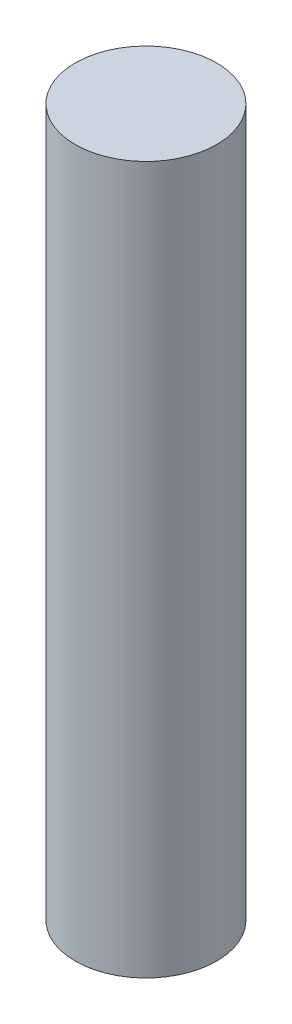
ISO-10303-21;
HEADER;
FILE_DESCRIPTION(('STEP AP214'),'2;1');
FILE_NAME('part.step','',(''),(''),'','','');
FILE_SCHEMA(('AUTOMOTIVE_DESIGN { 1 0 10303 214 1 1 1 1 }'));
ENDSEC;
DATA;
#1=APPLICATION_CONTEXT('core data for automotive mechanical design processes');
#2=APPLICATION_PROTOCOL_DEFINITION('international standard','automotive_design',2000,#1);
#3=PRODUCT_CONTEXT('',#1,'mechanical');
#4=PRODUCT('Part','Part','',(#3));
#5=PRODUCT_RELATED_PRODUCT_CATEGORY('part','',(#4));
#6=PRODUCT_DEFINITION_FORMATION('','',#4);
#7=PRODUCT_DEFINITION_CONTEXT('part definition',#1,'design');
#8=PRODUCT_DEFINITION('design','',#6,#7);
#9=PRODUCT_DEFINITION_SHAPE('','',#8);
#10=(LENGTH_UNIT() NAMED_UNIT(*) SI_UNIT(.MILLI.,.METRE.));
#11=(NAMED_UNIT(*) PLANE_ANGLE_UNIT() SI_UNIT($,.RADIAN.));
#12=(NAMED_UNIT(*) SI_UNIT($,.STERADIAN.) SOLID_ANGLE_UNIT());
#13=UNCERTAINTY_MEASURE_WITH_UNIT(LENGTH_MEASURE(1.E-05),#10,'distance_accuracy_value','');
#14=(GEOMETRIC_REPRESENTATION_CONTEXT(3) GLOBAL_UNCERTAINTY_ASSIGNED_CONTEXT((#13)) GLOBAL_UNIT_ASSIGNED_CONTEXT((#10,
#11,#12)) REPRESENTATION_CONTEXT('',''));
#15=CARTESIAN_POINT('',(0.,0.,0.));
#16=DIRECTION('',(0.,0.,1.));
#17=DIRECTION('',(1.,0.,0.));
#18=AXIS2_PLACEMENT_3D('',#15,#16,#17);
#19=CARTESIAN_POINT('',(0.,50.,0.));
#20=DIRECTION('',(0.,-1.,0.));
#21=DIRECTION('',(0.,0.,-1.));
#22=AXIS2_PLACEMENT_3D('',#19,#20,#21);
#23=CYLINDRICAL_SURFACE('',#22,5.);
#24=CARTESIAN_POINT('',(0.,50.,0.));
#25=DIRECTION('',(0.,1.,0.));
#26=DIRECTION('',(0.,0.,1.));
#27=AXIS2_PLACEMENT_3D('',#24,#25,#26);
#28=CIRCLE('',#27,5.);
#29=CARTESIAN_POINT('',(0.,50.,5.));
#30=VERTEX_POINT('',#29);
#31=EDGE_CURVE('E10',#30,#30,#28,.T.);
#32=ORIENTED_EDGE('',*,*,#31,.F.);
#33=EDGE_LOOP('',(#32));
#34=FACE_BOUND('',#33,.T.);
#35=CARTESIAN_POINT('',(0.,0.,0.));
#36=DIRECTION('',(0.,1.,0.));
#37=DIRECTION('',(0.,0.,1.));
#38=AXIS2_PLACEMENT_3D('',#35,#36,#37);
#39=CIRCLE('',#38,5.);
#40=CARTESIAN_POINT('',(0.,0.,5.));
#41=VERTEX_POINT('',#40);
#42=EDGE_CURVE('E35',#41,#41,#39,.T.);
#43=ORIENTED_EDGE('',*,*,#42,.T.);
#44=EDGE_LOOP('',(#43));
#45=FACE_BOUND('',#44,.T.);
#46=ADVANCED_FACE('F32',(#34,#45),#23,.T.);
#47=CARTESIAN_POINT('',(0.,50.,0.));
#48=DIRECTION('',(0.,1.,0.));
#49=DIRECTION('',(0.,0.,1.));
#50=AXIS2_PLACEMENT_3D('',#47,#48,#49);
#51=PLANE('',#50);
#52=ORIENTED_EDGE('',*,*,#31,.T.);
#53=EDGE_LOOP('',(#52));
#54=FACE_BOUND('',#53,.T.);
#55=ADVANCED_FACE('F47',(#54),#51,.T.);
#56=CARTESIAN_POINT('',(0.,0.,0.));
#57=DIRECTION('',(0.,1.,0.));
#58=DIRECTION('',(0.,0.,1.));
#59=AXIS2_PLACEMENT_3D('',#56,#57,#58);
#60=PLANE('',#59);
#61=ORIENTED_EDGE('',*,*,#42,.F.);
#62=EDGE_LOOP('',(#61));
#63=FACE_BOUND('',#62,.T.);
#64=ADVANCED_FACE('F45',(#63),#60,.F.);
#65=CLOSED_SHELL('',(#46,#55,#64));
#66=MANIFOLD_SOLID_BREP('B2',#65);
#67=ADVANCED_BREP_SHAPE_REPRESENTATION('',(#18,#66),#14);
#68=SHAPE_DEFINITION_REPRESENTATION(#9,#67);
ENDSEC;
END-ISO-10303-21;
